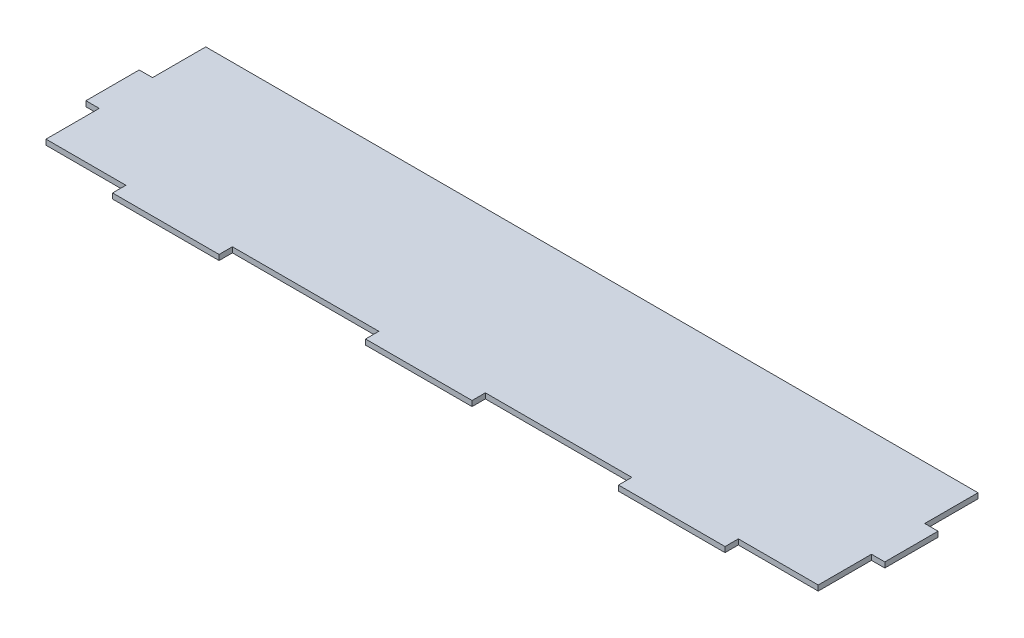
ISO-10303-21;
HEADER;
FILE_DESCRIPTION(('STEP AP214'),'2;1');
FILE_NAME('part.step','',(''),(''),'','','');
FILE_SCHEMA(('AUTOMOTIVE_DESIGN { 1 0 10303 214 1 1 1 1 }'));
ENDSEC;
DATA;
#1=APPLICATION_CONTEXT('core data for automotive mechanical design processes');
#2=APPLICATION_PROTOCOL_DEFINITION('international standard','automotive_design',2000,#1);
#3=PRODUCT_CONTEXT('',#1,'mechanical');
#4=PRODUCT('Part','Part','',(#3));
#5=PRODUCT_RELATED_PRODUCT_CATEGORY('part','',(#4));
#6=PRODUCT_DEFINITION_FORMATION('','',#4);
#7=PRODUCT_DEFINITION_CONTEXT('part definition',#1,'design');
#8=PRODUCT_DEFINITION('design','',#6,#7);
#9=PRODUCT_DEFINITION_SHAPE('','',#8);
#10=(LENGTH_UNIT() NAMED_UNIT(*) SI_UNIT(.MILLI.,.METRE.));
#11=(NAMED_UNIT(*) PLANE_ANGLE_UNIT() SI_UNIT($,.RADIAN.));
#12=(NAMED_UNIT(*) SI_UNIT($,.STERADIAN.) SOLID_ANGLE_UNIT());
#13=UNCERTAINTY_MEASURE_WITH_UNIT(LENGTH_MEASURE(1.E-05),#10,'distance_accuracy_value','');
#14=(GEOMETRIC_REPRESENTATION_CONTEXT(3) GLOBAL_UNCERTAINTY_ASSIGNED_CONTEXT((#13)) GLOBAL_UNIT_ASSIGNED_CONTEXT((#10,
#11,#12)) REPRESENTATION_CONTEXT('',''));
#15=CARTESIAN_POINT('',(0.,0.,0.));
#16=DIRECTION('',(0.,0.,1.));
#17=DIRECTION('',(1.,0.,0.));
#18=AXIS2_PLACEMENT_3D('',#15,#16,#17);
#19=CARTESIAN_POINT('',(215.9,2.54,0.));
#20=DIRECTION('',(1.,0.,0.));
#21=DIRECTION('',(0.,0.,-1.));
#22=AXIS2_PLACEMENT_3D('',#19,#20,#21);
#23=PLANE('',#22);
#24=DIRECTION('',(0.,0.,1.));
#25=VECTOR('',#24,1.);
#26=CARTESIAN_POINT('',(215.9,0.,0.));
#27=LINE('',#26,#25);
#28=CARTESIAN_POINT('',(215.9,0.,38.3659866827179));
#29=VERTEX_POINT('',#28);
#30=CARTESIAN_POINT('',(215.9,0.,44.7159866827179));
#31=VERTEX_POINT('',#30);
#32=EDGE_CURVE('E221',#29,#31,#27,.T.);
#33=ORIENTED_EDGE('',*,*,#32,.F.);
#34=DIRECTION('',(0.,-1.,0.));
#35=VECTOR('',#34,1.);
#36=CARTESIAN_POINT('',(215.9,2.54,38.3659866827179));
#37=LINE('',#36,#35);
#38=CARTESIAN_POINT('',(215.9,2.54,38.3659866827179));
#39=VERTEX_POINT('',#38);
#40=EDGE_CURVE('E11',#39,#29,#37,.T.);
#41=ORIENTED_EDGE('',*,*,#40,.F.);
#42=DIRECTION('',(0.,0.,1.));
#43=VECTOR('',#42,1.);
#44=CARTESIAN_POINT('',(215.9,2.54,0.));
#45=LINE('',#44,#43);
#46=CARTESIAN_POINT('',(215.9,2.54,44.7159866827179));
#47=VERTEX_POINT('',#46);
#48=EDGE_CURVE('E283',#39,#47,#45,.T.);
#49=ORIENTED_EDGE('',*,*,#48,.T.);
#50=DIRECTION('',(0.,-1.,0.));
#51=VECTOR('',#50,1.);
#52=CARTESIAN_POINT('',(215.9,2.54,44.7159866827179));
#53=LINE('',#52,#51);
#54=EDGE_CURVE('E132',#47,#31,#53,.T.);
#55=ORIENTED_EDGE('',*,*,#54,.T.);
#56=EDGE_LOOP('',(#33,#41,#49,#55));
#57=FACE_BOUND('',#56,.T.);
#58=ADVANCED_FACE('F33',(#57),#23,.T.);
#59=CARTESIAN_POINT('',(0.,2.54,38.3659866827179));
#60=DIRECTION('',(0.,0.,-1.));
#61=DIRECTION('',(-1.,0.,0.));
#62=AXIS2_PLACEMENT_3D('',#59,#60,#61);
#63=PLANE('',#62);
#64=DIRECTION('',(1.,0.,0.));
#65=VECTOR('',#64,1.);
#66=CARTESIAN_POINT('',(0.,0.,38.3659866827179));
#67=LINE('',#66,#65);
#68=CARTESIAN_POINT('',(285.75,0.,38.3659866827179));
#69=VERTEX_POINT('',#68);
#70=EDGE_CURVE('E224',#29,#69,#67,.T.);
#71=ORIENTED_EDGE('',*,*,#70,.T.);
#72=DIRECTION('',(0.,-1.,0.));
#73=VECTOR('',#72,1.);
#74=CARTESIAN_POINT('',(285.75,2.54,38.3659866827179));
#75=LINE('',#74,#73);
#76=CARTESIAN_POINT('',(285.75,2.54,38.3659866827179));
#77=VERTEX_POINT('',#76);
#78=EDGE_CURVE('E41',#77,#69,#75,.T.);
#79=ORIENTED_EDGE('',*,*,#78,.F.);
#80=DIRECTION('',(1.,0.,0.));
#81=VECTOR('',#80,1.);
#82=CARTESIAN_POINT('',(0.,2.54,38.3659866827179));
#83=LINE('',#82,#81);
#84=EDGE_CURVE('E352',#39,#77,#83,.T.);
#85=ORIENTED_EDGE('',*,*,#84,.F.);
#86=ORIENTED_EDGE('',*,*,#40,.T.);
#87=EDGE_LOOP('',(#71,#79,#85,#86));
#88=FACE_BOUND('',#87,.T.);
#89=ADVANCED_FACE('F399',(#88),#63,.F.);
#90=CARTESIAN_POINT('',(285.75,2.54,0.));
#91=DIRECTION('',(1.,0.,0.));
#92=DIRECTION('',(0.,0.,-1.));
#93=AXIS2_PLACEMENT_3D('',#90,#91,#92);
#94=PLANE('',#93);
#95=DIRECTION('',(0.,0.,1.));
#96=VECTOR('',#95,1.);
#97=CARTESIAN_POINT('',(285.75,0.,0.));
#98=LINE('',#97,#96);
#99=CARTESIAN_POINT('',(285.75,0.,44.7159866827179));
#100=VERTEX_POINT('',#99);
#101=EDGE_CURVE('E226',#69,#100,#98,.T.);
#102=ORIENTED_EDGE('',*,*,#101,.T.);
#103=DIRECTION('',(0.,-1.,0.));
#104=VECTOR('',#103,1.);
#105=CARTESIAN_POINT('',(285.75,2.54,44.7159866827179));
#106=LINE('',#105,#104);
#107=CARTESIAN_POINT('',(285.75,2.54,44.7159866827179));
#108=VERTEX_POINT('',#107);
#109=EDGE_CURVE('E325',#108,#100,#106,.T.);
#110=ORIENTED_EDGE('',*,*,#109,.F.);
#111=DIRECTION('',(0.,0.,1.));
#112=VECTOR('',#111,1.);
#113=CARTESIAN_POINT('',(285.75,2.54,0.));
#114=LINE('',#113,#112);
#115=EDGE_CURVE('E333',#77,#108,#114,.T.);
#116=ORIENTED_EDGE('',*,*,#115,.F.);
#117=ORIENTED_EDGE('',*,*,#78,.T.);
#118=EDGE_LOOP('',(#102,#110,#116,#117));
#119=FACE_BOUND('',#118,.T.);
#120=ADVANCED_FACE('F331',(#119),#94,.F.);
#121=CARTESIAN_POINT('',(0.,2.54,44.715986682718));
#122=DIRECTION('',(0.,0.,1.));
#123=DIRECTION('',(1.,0.,0.));
#124=AXIS2_PLACEMENT_3D('',#121,#122,#123);
#125=PLANE('',#124);
#126=DIRECTION('',(-1.,0.,0.));
#127=VECTOR('',#126,1.);
#128=CARTESIAN_POINT('',(0.,0.,44.715986682718));
#129=LINE('',#128,#127);
#130=CARTESIAN_POINT('',(336.55,0.,44.7159866827179));
#131=VERTEX_POINT('',#130);
#132=EDGE_CURVE('E229',#131,#100,#129,.T.);
#133=ORIENTED_EDGE('',*,*,#132,.F.);
#134=DIRECTION('',(0.,-1.,0.));
#135=VECTOR('',#134,1.);
#136=CARTESIAN_POINT('',(336.55,2.54,44.7159866827179));
#137=LINE('',#136,#135);
#138=CARTESIAN_POINT('',(336.55,2.54,44.7159866827179));
#139=VERTEX_POINT('',#138);
#140=EDGE_CURVE('E323',#139,#131,#137,.T.);
#141=ORIENTED_EDGE('',*,*,#140,.F.);
#142=DIRECTION('',(-1.,0.,0.));
#143=VECTOR('',#142,1.);
#144=CARTESIAN_POINT('',(0.,2.54,44.715986682718));
#145=LINE('',#144,#143);
#146=EDGE_CURVE('E345',#139,#108,#145,.T.);
#147=ORIENTED_EDGE('',*,*,#146,.T.);
#148=ORIENTED_EDGE('',*,*,#109,.T.);
#149=EDGE_LOOP('',(#133,#141,#147,#148));
#150=FACE_BOUND('',#149,.T.);
#151=ADVANCED_FACE('F342',(#150),#125,.T.);
#152=CARTESIAN_POINT('',(336.55,2.54,0.));
#153=DIRECTION('',(1.,0.,0.));
#154=DIRECTION('',(0.,0.,-1.));
#155=AXIS2_PLACEMENT_3D('',#152,#153,#154);
#156=PLANE('',#155);
#157=DIRECTION('',(0.,0.,1.));
#158=VECTOR('',#157,1.);
#159=CARTESIAN_POINT('',(336.55,0.,0.));
#160=LINE('',#159,#158);
#161=CARTESIAN_POINT('',(336.55,0.,38.3659866827179));
#162=VERTEX_POINT('',#161);
#163=EDGE_CURVE('E232',#162,#131,#160,.T.);
#164=ORIENTED_EDGE('',*,*,#163,.F.);
#165=DIRECTION('',(0.,-1.,0.));
#166=VECTOR('',#165,1.);
#167=CARTESIAN_POINT('',(336.55,2.54,38.3659866827179));
#168=LINE('',#167,#166);
#169=CARTESIAN_POINT('',(336.55,2.54,38.3659866827179));
#170=VERTEX_POINT('',#169);
#171=EDGE_CURVE('E321',#170,#162,#168,.T.);
#172=ORIENTED_EDGE('',*,*,#171,.F.);
#173=DIRECTION('',(0.,0.,1.));
#174=VECTOR('',#173,1.);
#175=CARTESIAN_POINT('',(336.55,2.54,0.));
#176=LINE('',#175,#174);
#177=EDGE_CURVE('E348',#170,#139,#176,.T.);
#178=ORIENTED_EDGE('',*,*,#177,.T.);
#179=ORIENTED_EDGE('',*,*,#140,.T.);
#180=EDGE_LOOP('',(#164,#172,#178,#179));
#181=FACE_BOUND('',#180,.T.);
#182=ADVANCED_FACE('F409',(#181),#156,.T.);
#183=CARTESIAN_POINT('',(0.,2.54,38.3659866827179));
#184=DIRECTION('',(0.,0.,-1.));
#185=DIRECTION('',(-1.,0.,0.));
#186=AXIS2_PLACEMENT_3D('',#183,#184,#185);
#187=PLANE('',#186);
#188=DIRECTION('',(1.,0.,0.));
#189=VECTOR('',#188,1.);
#190=CARTESIAN_POINT('',(0.,0.,38.3659866827179));
#191=LINE('',#190,#189);
#192=CARTESIAN_POINT('',(374.65,0.,38.3659866827179));
#193=VERTEX_POINT('',#192);
#194=EDGE_CURVE('E235',#162,#193,#191,.T.);
#195=ORIENTED_EDGE('',*,*,#194,.T.);
#196=DIRECTION('',(0.,-1.,0.));
#197=VECTOR('',#196,1.);
#198=CARTESIAN_POINT('',(374.65,2.54,38.3659866827179));
#199=LINE('',#198,#197);
#200=CARTESIAN_POINT('',(374.65,2.54,38.3659866827179));
#201=VERTEX_POINT('',#200);
#202=EDGE_CURVE('E318',#201,#193,#199,.T.);
#203=ORIENTED_EDGE('',*,*,#202,.F.);
#204=DIRECTION('',(1.,0.,0.));
#205=VECTOR('',#204,1.);
#206=CARTESIAN_POINT('',(0.,2.54,38.3659866827179));
#207=LINE('',#206,#205);
#208=EDGE_CURVE('E350',#170,#201,#207,.T.);
#209=ORIENTED_EDGE('',*,*,#208,.F.);
#210=ORIENTED_EDGE('',*,*,#171,.T.);
#211=EDGE_LOOP('',(#195,#203,#209,#210));
#212=FACE_BOUND('',#211,.T.);
#213=ADVANCED_FACE('F412',(#212),#187,.F.);
#214=CARTESIAN_POINT('',(374.65,2.54,0.));
#215=DIRECTION('',(-1.,0.,0.));
#216=DIRECTION('',(0.,0.,1.));
#217=AXIS2_PLACEMENT_3D('',#214,#215,#216);
#218=PLANE('',#217);
#219=DIRECTION('',(0.,0.,-1.));
#220=VECTOR('',#219,1.);
#221=CARTESIAN_POINT('',(374.65,0.,0.));
#222=LINE('',#221,#220);
#223=CARTESIAN_POINT('',(374.65,0.,12.9659866827179));
#224=VERTEX_POINT('',#223);
#225=EDGE_CURVE('E237',#193,#224,#222,.T.);
#226=ORIENTED_EDGE('',*,*,#225,.T.);
#227=DIRECTION('',(0.,-1.,0.));
#228=VECTOR('',#227,1.);
#229=CARTESIAN_POINT('',(374.65,2.54,12.9659866827179));
#230=LINE('',#229,#228);
#231=CARTESIAN_POINT('',(374.65,2.54,12.9659866827179));
#232=VERTEX_POINT('',#231);
#233=EDGE_CURVE('E316',#232,#224,#230,.T.);
#234=ORIENTED_EDGE('',*,*,#233,.F.);
#235=DIRECTION('',(0.,0.,-1.));
#236=VECTOR('',#235,1.);
#237=CARTESIAN_POINT('',(374.65,2.54,0.));
#238=LINE('',#237,#236);
#239=EDGE_CURVE('E357',#201,#232,#238,.T.);
#240=ORIENTED_EDGE('',*,*,#239,.F.);
#241=ORIENTED_EDGE('',*,*,#202,.T.);
#242=EDGE_LOOP('',(#226,#234,#240,#241));
#243=FACE_BOUND('',#242,.T.);
#244=ADVANCED_FACE('F416',(#243),#218,.F.);
#245=CARTESIAN_POINT('',(0.,2.54,12.9659866827179));
#246=DIRECTION('',(0.,0.,1.));
#247=DIRECTION('',(1.,0.,0.));
#248=AXIS2_PLACEMENT_3D('',#245,#246,#247);
#249=PLANE('',#248);
#250=DIRECTION('',(-1.,0.,0.));
#251=VECTOR('',#250,1.);
#252=CARTESIAN_POINT('',(0.,0.,12.9659866827179));
#253=LINE('',#252,#251);
#254=CARTESIAN_POINT('',(381.,0.,12.9659866827179));
#255=VERTEX_POINT('',#254);
#256=EDGE_CURVE('E240',#255,#224,#253,.T.);
#257=ORIENTED_EDGE('',*,*,#256,.F.);
#258=DIRECTION('',(0.,-1.,0.));
#259=VECTOR('',#258,1.);
#260=CARTESIAN_POINT('',(381.,2.54,12.9659866827179));
#261=LINE('',#260,#259);
#262=CARTESIAN_POINT('',(381.,2.54,12.9659866827179));
#263=VERTEX_POINT('',#262);
#264=EDGE_CURVE('E314',#263,#255,#261,.T.);
#265=ORIENTED_EDGE('',*,*,#264,.F.);
#266=DIRECTION('',(-1.,0.,0.));
#267=VECTOR('',#266,1.);
#268=CARTESIAN_POINT('',(0.,2.54,12.9659866827179));
#269=LINE('',#268,#267);
#270=EDGE_CURVE('E359',#263,#232,#269,.T.);
#271=ORIENTED_EDGE('',*,*,#270,.T.);
#272=ORIENTED_EDGE('',*,*,#233,.T.);
#273=EDGE_LOOP('',(#257,#265,#271,#272));
#274=FACE_BOUND('',#273,.T.);
#275=ADVANCED_FACE('F420',(#274),#249,.T.);
#276=CARTESIAN_POINT('',(381.,2.54,0.));
#277=DIRECTION('',(1.,0.,0.));
#278=DIRECTION('',(0.,0.,-1.));
#279=AXIS2_PLACEMENT_3D('',#276,#277,#278);
#280=PLANE('',#279);
#281=DIRECTION('',(0.,0.,1.));
#282=VECTOR('',#281,1.);
#283=CARTESIAN_POINT('',(381.,0.,0.));
#284=LINE('',#283,#282);
#285=CARTESIAN_POINT('',(381.,0.,-12.4340133172821));
#286=VERTEX_POINT('',#285);
#287=EDGE_CURVE('E243',#286,#255,#284,.T.);
#288=ORIENTED_EDGE('',*,*,#287,.F.);
#289=DIRECTION('',(0.,-1.,0.));
#290=VECTOR('',#289,1.);
#291=CARTESIAN_POINT('',(381.,2.54,-12.4340133172821));
#292=LINE('',#291,#290);
#293=CARTESIAN_POINT('',(381.,2.54,-12.4340133172821));
#294=VERTEX_POINT('',#293);
#295=EDGE_CURVE('E312',#294,#286,#292,.T.);
#296=ORIENTED_EDGE('',*,*,#295,.F.);
#297=DIRECTION('',(0.,0.,1.));
#298=VECTOR('',#297,1.);
#299=CARTESIAN_POINT('',(381.,2.54,0.));
#300=LINE('',#299,#298);
#301=EDGE_CURVE('E362',#294,#263,#300,.T.);
#302=ORIENTED_EDGE('',*,*,#301,.T.);
#303=ORIENTED_EDGE('',*,*,#264,.T.);
#304=EDGE_LOOP('',(#288,#296,#302,#303));
#305=FACE_BOUND('',#304,.T.);
#306=ADVANCED_FACE('F424',(#305),#280,.T.);
#307=CARTESIAN_POINT('',(0.,2.54,-12.4340133172821));
#308=DIRECTION('',(0.,0.,1.));
#309=DIRECTION('',(1.,0.,0.));
#310=AXIS2_PLACEMENT_3D('',#307,#308,#309);
#311=PLANE('',#310);
#312=DIRECTION('',(-1.,0.,0.));
#313=VECTOR('',#312,1.);
#314=CARTESIAN_POINT('',(0.,0.,-12.4340133172821));
#315=LINE('',#314,#313);
#316=CARTESIAN_POINT('',(374.65,0.,-12.4340133172821));
#317=VERTEX_POINT('',#316);
#318=EDGE_CURVE('E246',#286,#317,#315,.T.);
#319=ORIENTED_EDGE('',*,*,#318,.T.);
#320=DIRECTION('',(0.,-1.,0.));
#321=VECTOR('',#320,1.);
#322=CARTESIAN_POINT('',(374.65,2.54,-12.4340133172821));
#323=LINE('',#322,#321);
#324=CARTESIAN_POINT('',(374.65,2.54,-12.4340133172821));
#325=VERTEX_POINT('',#324);
#326=EDGE_CURVE('E310',#325,#317,#323,.T.);
#327=ORIENTED_EDGE('',*,*,#326,.F.);
#328=DIRECTION('',(-1.,0.,0.));
#329=VECTOR('',#328,1.);
#330=CARTESIAN_POINT('',(0.,2.54,-12.4340133172821));
#331=LINE('',#330,#329);
#332=EDGE_CURVE('E365',#294,#325,#331,.T.);
#333=ORIENTED_EDGE('',*,*,#332,.F.);
#334=ORIENTED_EDGE('',*,*,#295,.T.);
#335=EDGE_LOOP('',(#319,#327,#333,#334));
#336=FACE_BOUND('',#335,.T.);
#337=ADVANCED_FACE('F428',(#336),#311,.F.);
#338=CARTESIAN_POINT('',(374.65,2.54,0.));
#339=DIRECTION('',(1.,0.,0.));
#340=DIRECTION('',(0.,0.,-1.));
#341=AXIS2_PLACEMENT_3D('',#338,#339,#340);
#342=PLANE('',#341);
#343=DIRECTION('',(0.,0.,1.));
#344=VECTOR('',#343,1.);
#345=CARTESIAN_POINT('',(374.65,0.,0.));
#346=LINE('',#345,#344);
#347=CARTESIAN_POINT('',(374.65,0.,-37.8340133172821));
#348=VERTEX_POINT('',#347);
#349=EDGE_CURVE('E249',#348,#317,#346,.T.);
#350=ORIENTED_EDGE('',*,*,#349,.F.);
#351=DIRECTION('',(0.,-1.,0.));
#352=VECTOR('',#351,1.);
#353=CARTESIAN_POINT('',(374.65,2.54,-37.8340133172821));
#354=LINE('',#353,#352);
#355=CARTESIAN_POINT('',(374.65,2.54,-37.8340133172821));
#356=VERTEX_POINT('',#355);
#357=EDGE_CURVE('E308',#356,#348,#354,.T.);
#358=ORIENTED_EDGE('',*,*,#357,.F.);
#359=DIRECTION('',(0.,0.,1.));
#360=VECTOR('',#359,1.);
#361=CARTESIAN_POINT('',(374.65,2.54,0.));
#362=LINE('',#361,#360);
#363=EDGE_CURVE('E367',#356,#325,#362,.T.);
#364=ORIENTED_EDGE('',*,*,#363,.T.);
#365=ORIENTED_EDGE('',*,*,#326,.T.);
#366=EDGE_LOOP('',(#350,#358,#364,#365));
#367=FACE_BOUND('',#366,.T.);
#368=ADVANCED_FACE('F432',(#367),#342,.T.);
#369=CARTESIAN_POINT('',(0.,2.54,-37.8340133172821));
#370=DIRECTION('',(0.,0.,-1.));
#371=DIRECTION('',(-1.,0.,0.));
#372=AXIS2_PLACEMENT_3D('',#369,#370,#371);
#373=PLANE('',#372);
#374=DIRECTION('',(1.,0.,0.));
#375=VECTOR('',#374,1.);
#376=CARTESIAN_POINT('',(0.,0.,-37.8340133172821));
#377=LINE('',#376,#375);
#378=CARTESIAN_POINT('',(6.35,0.,-37.8340133172821));
#379=VERTEX_POINT('',#378);
#380=EDGE_CURVE('E252',#379,#348,#377,.T.);
#381=ORIENTED_EDGE('',*,*,#380,.F.);
#382=DIRECTION('',(0.,-1.,0.));
#383=VECTOR('',#382,1.);
#384=CARTESIAN_POINT('',(6.35,2.54,-37.8340133172821));
#385=LINE('',#384,#383);
#386=CARTESIAN_POINT('',(6.35,2.54,-37.8340133172821));
#387=VERTEX_POINT('',#386);
#388=EDGE_CURVE('E306',#387,#379,#385,.T.);
#389=ORIENTED_EDGE('',*,*,#388,.F.);
#390=DIRECTION('',(1.,0.,0.));
#391=VECTOR('',#390,1.);
#392=CARTESIAN_POINT('',(0.,2.54,-37.8340133172821));
#393=LINE('',#392,#391);
#394=EDGE_CURVE('E370',#387,#356,#393,.T.);
#395=ORIENTED_EDGE('',*,*,#394,.T.);
#396=ORIENTED_EDGE('',*,*,#357,.T.);
#397=EDGE_LOOP('',(#381,#389,#395,#396));
#398=FACE_BOUND('',#397,.T.);
#399=ADVANCED_FACE('F436',(#398),#373,.T.);
#400=CARTESIAN_POINT('',(6.35000000000001,2.54,0.));
#401=DIRECTION('',(1.,0.,0.));
#402=DIRECTION('',(0.,0.,-1.));
#403=AXIS2_PLACEMENT_3D('',#400,#401,#402);
#404=PLANE('',#403);
#405=DIRECTION('',(0.,0.,1.));
#406=VECTOR('',#405,1.);
#407=CARTESIAN_POINT('',(6.35000000000001,0.,0.));
#408=LINE('',#407,#406);
#409=CARTESIAN_POINT('',(6.35000000000001,0.,-12.4340133172821));
#410=VERTEX_POINT('',#409);
#411=EDGE_CURVE('E255',#379,#410,#408,.T.);
#412=ORIENTED_EDGE('',*,*,#411,.T.);
#413=DIRECTION('',(0.,-1.,0.));
#414=VECTOR('',#413,1.);
#415=CARTESIAN_POINT('',(6.35000000000001,2.54,-12.4340133172821));
#416=LINE('',#415,#414);
#417=CARTESIAN_POINT('',(6.35000000000001,2.54,-12.4340133172821));
#418=VERTEX_POINT('',#417);
#419=EDGE_CURVE('E304',#418,#410,#416,.T.);
#420=ORIENTED_EDGE('',*,*,#419,.F.);
#421=DIRECTION('',(0.,0.,1.));
#422=VECTOR('',#421,1.);
#423=CARTESIAN_POINT('',(6.35000000000001,2.54,0.));
#424=LINE('',#423,#422);
#425=EDGE_CURVE('E373',#387,#418,#424,.T.);
#426=ORIENTED_EDGE('',*,*,#425,.F.);
#427=ORIENTED_EDGE('',*,*,#388,.T.);
#428=EDGE_LOOP('',(#412,#420,#426,#427));
#429=FACE_BOUND('',#428,.T.);
#430=ADVANCED_FACE('F440',(#429),#404,.F.);
#431=CARTESIAN_POINT('',(0.,2.54,-12.4340133172821));
#432=DIRECTION('',(0.,0.,-1.));
#433=DIRECTION('',(-1.,0.,0.));
#434=AXIS2_PLACEMENT_3D('',#431,#432,#433);
#435=PLANE('',#434);
#436=DIRECTION('',(1.,0.,0.));
#437=VECTOR('',#436,1.);
#438=CARTESIAN_POINT('',(0.,0.,-12.4340133172821));
#439=LINE('',#438,#437);
#440=CARTESIAN_POINT('',(0.,0.,-12.4340133172821));
#441=VERTEX_POINT('',#440);
#442=EDGE_CURVE('E258',#441,#410,#439,.T.);
#443=ORIENTED_EDGE('',*,*,#442,.F.);
#444=DIRECTION('',(0.,-1.,0.));
#445=VECTOR('',#444,1.);
#446=CARTESIAN_POINT('',(0.,2.54,-12.4340133172821));
#447=LINE('',#446,#445);
#448=CARTESIAN_POINT('',(0.,2.54,-12.4340133172821));
#449=VERTEX_POINT('',#448);
#450=EDGE_CURVE('E302',#449,#441,#447,.T.);
#451=ORIENTED_EDGE('',*,*,#450,.F.);
#452=DIRECTION('',(1.,0.,0.));
#453=VECTOR('',#452,1.);
#454=CARTESIAN_POINT('',(0.,2.54,-12.4340133172821));
#455=LINE('',#454,#453);
#456=EDGE_CURVE('E375',#449,#418,#455,.T.);
#457=ORIENTED_EDGE('',*,*,#456,.T.);
#458=ORIENTED_EDGE('',*,*,#419,.T.);
#459=EDGE_LOOP('',(#443,#451,#457,#458));
#460=FACE_BOUND('',#459,.T.);
#461=ADVANCED_FACE('F444',(#460),#435,.T.);
#462=CARTESIAN_POINT('',(0.,2.54,0.));
#463=DIRECTION('',(1.,0.,0.));
#464=DIRECTION('',(0.,0.,-1.));
#465=AXIS2_PLACEMENT_3D('',#462,#463,#464);
#466=PLANE('',#465);
#467=DIRECTION('',(0.,0.,1.));
#468=VECTOR('',#467,1.);
#469=CARTESIAN_POINT('',(0.,0.,0.));
#470=LINE('',#469,#468);
#471=CARTESIAN_POINT('',(0.,0.,12.9659866827179));
#472=VERTEX_POINT('',#471);
#473=EDGE_CURVE('E261',#441,#472,#470,.T.);
#474=ORIENTED_EDGE('',*,*,#473,.T.);
#475=DIRECTION('',(0.,-1.,0.));
#476=VECTOR('',#475,1.);
#477=CARTESIAN_POINT('',(0.,2.54,12.9659866827179));
#478=LINE('',#477,#476);
#479=CARTESIAN_POINT('',(0.,2.54,12.9659866827179));
#480=VERTEX_POINT('',#479);
#481=EDGE_CURVE('E299',#480,#472,#478,.T.);
#482=ORIENTED_EDGE('',*,*,#481,.F.);
#483=DIRECTION('',(0.,0.,1.));
#484=VECTOR('',#483,1.);
#485=CARTESIAN_POINT('',(0.,2.54,0.));
#486=LINE('',#485,#484);
#487=EDGE_CURVE('E378',#449,#480,#486,.T.);
#488=ORIENTED_EDGE('',*,*,#487,.F.);
#489=ORIENTED_EDGE('',*,*,#450,.T.);
#490=EDGE_LOOP('',(#474,#482,#488,#489));
#491=FACE_BOUND('',#490,.T.);
#492=ADVANCED_FACE('F448',(#491),#466,.F.);
#493=CARTESIAN_POINT('',(0.,2.54,12.9659866827179));
#494=DIRECTION('',(0.,0.,-1.));
#495=DIRECTION('',(-1.,0.,0.));
#496=AXIS2_PLACEMENT_3D('',#493,#494,#495);
#497=PLANE('',#496);
#498=DIRECTION('',(1.,0.,0.));
#499=VECTOR('',#498,1.);
#500=CARTESIAN_POINT('',(0.,0.,12.9659866827179));
#501=LINE('',#500,#499);
#502=CARTESIAN_POINT('',(6.35000000000001,0.,12.9659866827179));
#503=VERTEX_POINT('',#502);
#504=EDGE_CURVE('E263',#472,#503,#501,.T.);
#505=ORIENTED_EDGE('',*,*,#504,.T.);
#506=DIRECTION('',(0.,-1.,0.));
#507=VECTOR('',#506,1.);
#508=CARTESIAN_POINT('',(6.35000000000001,2.54,12.9659866827179));
#509=LINE('',#508,#507);
#510=CARTESIAN_POINT('',(6.35000000000001,2.54,12.9659866827179));
#511=VERTEX_POINT('',#510);
#512=EDGE_CURVE('E297',#511,#503,#509,.T.);
#513=ORIENTED_EDGE('',*,*,#512,.F.);
#514=DIRECTION('',(1.,0.,0.));
#515=VECTOR('',#514,1.);
#516=CARTESIAN_POINT('',(0.,2.54,12.9659866827179));
#517=LINE('',#516,#515);
#518=EDGE_CURVE('E380',#480,#511,#517,.T.);
#519=ORIENTED_EDGE('',*,*,#518,.F.);
#520=ORIENTED_EDGE('',*,*,#481,.T.);
#521=EDGE_LOOP('',(#505,#513,#519,#520));
#522=FACE_BOUND('',#521,.T.);
#523=ADVANCED_FACE('F452',(#522),#497,.F.);
#524=CARTESIAN_POINT('',(6.35000000000001,2.54,0.));
#525=DIRECTION('',(-1.,0.,0.));
#526=DIRECTION('',(0.,0.,1.));
#527=AXIS2_PLACEMENT_3D('',#524,#525,#526);
#528=PLANE('',#527);
#529=DIRECTION('',(0.,0.,-1.));
#530=VECTOR('',#529,1.);
#531=CARTESIAN_POINT('',(6.35000000000001,0.,0.));
#532=LINE('',#531,#530);
#533=CARTESIAN_POINT('',(6.35000000000001,0.,38.3659866827179));
#534=VERTEX_POINT('',#533);
#535=EDGE_CURVE('E266',#534,#503,#532,.T.);
#536=ORIENTED_EDGE('',*,*,#535,.F.);
#537=DIRECTION('',(0.,-1.,0.));
#538=VECTOR('',#537,1.);
#539=CARTESIAN_POINT('',(6.35000000000001,2.54,38.3659866827179));
#540=LINE('',#539,#538);
#541=CARTESIAN_POINT('',(6.35000000000001,2.54,38.3659866827179));
#542=VERTEX_POINT('',#541);
#543=EDGE_CURVE('E295',#542,#534,#540,.T.);
#544=ORIENTED_EDGE('',*,*,#543,.F.);
#545=DIRECTION('',(0.,0.,-1.));
#546=VECTOR('',#545,1.);
#547=CARTESIAN_POINT('',(6.35000000000001,2.54,0.));
#548=LINE('',#547,#546);
#549=EDGE_CURVE('E382',#542,#511,#548,.T.);
#550=ORIENTED_EDGE('',*,*,#549,.T.);
#551=ORIENTED_EDGE('',*,*,#512,.T.);
#552=EDGE_LOOP('',(#536,#544,#550,#551));
#553=FACE_BOUND('',#552,.T.);
#554=ADVANCED_FACE('F456',(#553),#528,.T.);
#555=CARTESIAN_POINT('',(0.,2.54,38.3659866827179));
#556=DIRECTION('',(0.,0.,-1.));
#557=DIRECTION('',(-1.,0.,0.));
#558=AXIS2_PLACEMENT_3D('',#555,#556,#557);
#559=PLANE('',#558);
#560=DIRECTION('',(1.,0.,0.));
#561=VECTOR('',#560,1.);
#562=CARTESIAN_POINT('',(0.,0.,38.3659866827179));
#563=LINE('',#562,#561);
#564=CARTESIAN_POINT('',(44.45,0.,38.3659866827179));
#565=VERTEX_POINT('',#564);
#566=EDGE_CURVE('E269',#534,#565,#563,.T.);
#567=ORIENTED_EDGE('',*,*,#566,.T.);
#568=DIRECTION('',(0.,-1.,0.));
#569=VECTOR('',#568,1.);
#570=CARTESIAN_POINT('',(44.45,2.54,38.3659866827179));
#571=LINE('',#570,#569);
#572=CARTESIAN_POINT('',(44.45,2.54,38.3659866827179));
#573=VERTEX_POINT('',#572);
#574=EDGE_CURVE('E292',#573,#565,#571,.T.);
#575=ORIENTED_EDGE('',*,*,#574,.F.);
#576=DIRECTION('',(1.,0.,0.));
#577=VECTOR('',#576,1.);
#578=CARTESIAN_POINT('',(0.,2.54,38.3659866827179));
#579=LINE('',#578,#577);
#580=EDGE_CURVE('E385',#542,#573,#579,.T.);
#581=ORIENTED_EDGE('',*,*,#580,.F.);
#582=ORIENTED_EDGE('',*,*,#543,.T.);
#583=EDGE_LOOP('',(#567,#575,#581,#582));
#584=FACE_BOUND('',#583,.T.);
#585=ADVANCED_FACE('F460',(#584),#559,.F.);
#586=CARTESIAN_POINT('',(44.45,2.54,0.));
#587=DIRECTION('',(1.,0.,0.));
#588=DIRECTION('',(0.,0.,-1.));
#589=AXIS2_PLACEMENT_3D('',#586,#587,#588);
#590=PLANE('',#589);
#591=DIRECTION('',(0.,0.,1.));
#592=VECTOR('',#591,1.);
#593=CARTESIAN_POINT('',(44.45,0.,0.));
#594=LINE('',#593,#592);
#595=CARTESIAN_POINT('',(44.45,0.,44.7159866827179));
#596=VERTEX_POINT('',#595);
#597=EDGE_CURVE('E271',#565,#596,#594,.T.);
#598=ORIENTED_EDGE('',*,*,#597,.T.);
#599=DIRECTION('',(0.,-1.,0.));
#600=VECTOR('',#599,1.);
#601=CARTESIAN_POINT('',(44.45,2.54,44.7159866827179));
#602=LINE('',#601,#600);
#603=CARTESIAN_POINT('',(44.45,2.54,44.7159866827179));
#604=VERTEX_POINT('',#603);
#605=EDGE_CURVE('E289',#604,#596,#602,.T.);
#606=ORIENTED_EDGE('',*,*,#605,.F.);
#607=DIRECTION('',(0.,0.,1.));
#608=VECTOR('',#607,1.);
#609=CARTESIAN_POINT('',(44.45,2.54,0.));
#610=LINE('',#609,#608);
#611=EDGE_CURVE('E387',#573,#604,#610,.T.);
#612=ORIENTED_EDGE('',*,*,#611,.F.);
#613=ORIENTED_EDGE('',*,*,#574,.T.);
#614=EDGE_LOOP('',(#598,#606,#612,#613));
#615=FACE_BOUND('',#614,.T.);
#616=ADVANCED_FACE('F464',(#615),#590,.F.);
#617=CARTESIAN_POINT('',(0.,2.54,44.7159866827179));
#618=DIRECTION('',(0.,0.,-1.));
#619=DIRECTION('',(-1.,0.,0.));
#620=AXIS2_PLACEMENT_3D('',#617,#618,#619);
#621=PLANE('',#620);
#622=DIRECTION('',(1.,0.,0.));
#623=VECTOR('',#622,1.);
#624=CARTESIAN_POINT('',(0.,0.,44.7159866827179));
#625=LINE('',#624,#623);
#626=CARTESIAN_POINT('',(95.25,0.,44.7159866827179));
#627=VERTEX_POINT('',#626);
#628=EDGE_CURVE('E273',#596,#627,#625,.T.);
#629=ORIENTED_EDGE('',*,*,#628,.T.);
#630=DIRECTION('',(0.,-1.,0.));
#631=VECTOR('',#630,1.);
#632=CARTESIAN_POINT('',(95.25,2.54,44.7159866827179));
#633=LINE('',#632,#631);
#634=CARTESIAN_POINT('',(95.25,2.54,44.7159866827179));
#635=VERTEX_POINT('',#634);
#636=EDGE_CURVE('E287',#635,#627,#633,.T.);
#637=ORIENTED_EDGE('',*,*,#636,.F.);
#638=DIRECTION('',(1.,0.,0.));
#639=VECTOR('',#638,1.);
#640=CARTESIAN_POINT('',(0.,2.54,44.7159866827179));
#641=LINE('',#640,#639);
#642=EDGE_CURVE('E389',#604,#635,#641,.T.);
#643=ORIENTED_EDGE('',*,*,#642,.F.);
#644=ORIENTED_EDGE('',*,*,#605,.T.);
#645=EDGE_LOOP('',(#629,#637,#643,#644));
#646=FACE_BOUND('',#645,.T.);
#647=ADVANCED_FACE('F468',(#646),#621,.F.);
#648=CARTESIAN_POINT('',(95.2500000000001,2.54,2.08166817117217E-13));
#649=DIRECTION('',(1.,0.,0.));
#650=DIRECTION('',(0.,0.,-1.));
#651=AXIS2_PLACEMENT_3D('',#648,#649,#650);
#652=PLANE('',#651);
#653=DIRECTION('',(0.,0.,1.));
#654=VECTOR('',#653,1.);
#655=CARTESIAN_POINT('',(95.2500000000001,0.,2.08166817117217E-13));
#656=LINE('',#655,#654);
#657=CARTESIAN_POINT('',(95.25,0.,38.3659866827179));
#658=VERTEX_POINT('',#657);
#659=EDGE_CURVE('E276',#658,#627,#656,.T.);
#660=ORIENTED_EDGE('',*,*,#659,.F.);
#661=DIRECTION('',(0.,-1.,0.));
#662=VECTOR('',#661,1.);
#663=CARTESIAN_POINT('',(95.25,2.54,38.3659866827179));
#664=LINE('',#663,#662);
#665=CARTESIAN_POINT('',(95.25,2.54,38.3659866827179));
#666=VERTEX_POINT('',#665);
#667=EDGE_CURVE('E213',#666,#658,#664,.T.);
#668=ORIENTED_EDGE('',*,*,#667,.F.);
#669=DIRECTION('',(0.,0.,1.));
#670=VECTOR('',#669,1.);
#671=CARTESIAN_POINT('',(95.2500000000001,2.54,2.08166817117217E-13));
#672=LINE('',#671,#670);
#673=EDGE_CURVE('E206',#666,#635,#672,.T.);
#674=ORIENTED_EDGE('',*,*,#673,.T.);
#675=ORIENTED_EDGE('',*,*,#636,.T.);
#676=EDGE_LOOP('',(#660,#668,#674,#675));
#677=FACE_BOUND('',#676,.T.);
#678=ADVANCED_FACE('F392',(#677),#652,.T.);
#679=CARTESIAN_POINT('',(0.,2.54,38.3659866827179));
#680=DIRECTION('',(0.,0.,-1.));
#681=DIRECTION('',(-1.,0.,0.));
#682=AXIS2_PLACEMENT_3D('',#679,#680,#681);
#683=PLANE('',#682);
#684=DIRECTION('',(1.,0.,0.));
#685=VECTOR('',#684,1.);
#686=CARTESIAN_POINT('',(0.,0.,38.3659866827179));
#687=LINE('',#686,#685);
#688=CARTESIAN_POINT('',(165.1,0.,38.3659866827179));
#689=VERTEX_POINT('',#688);
#690=EDGE_CURVE('E212',#658,#689,#687,.T.);
#691=ORIENTED_EDGE('',*,*,#690,.T.);
#692=DIRECTION('',(0.,-1.,0.));
#693=VECTOR('',#692,1.);
#694=CARTESIAN_POINT('',(165.1,2.54,38.3659866827179));
#695=LINE('',#694,#693);
#696=CARTESIAN_POINT('',(165.1,2.54,38.3659866827179));
#697=VERTEX_POINT('',#696);
#698=EDGE_CURVE('E209',#697,#689,#695,.T.);
#699=ORIENTED_EDGE('',*,*,#698,.F.);
#700=DIRECTION('',(1.,0.,0.));
#701=VECTOR('',#700,1.);
#702=CARTESIAN_POINT('',(0.,2.54,38.3659866827179));
#703=LINE('',#702,#701);
#704=EDGE_CURVE('E200',#666,#697,#703,.T.);
#705=ORIENTED_EDGE('',*,*,#704,.F.);
#706=ORIENTED_EDGE('',*,*,#667,.T.);
#707=EDGE_LOOP('',(#691,#699,#705,#706));
#708=FACE_BOUND('',#707,.T.);
#709=ADVANCED_FACE('F210',(#708),#683,.F.);
#710=CARTESIAN_POINT('',(165.1,2.54,0.));
#711=DIRECTION('',(1.,0.,0.));
#712=DIRECTION('',(0.,0.,-1.));
#713=AXIS2_PLACEMENT_3D('',#710,#711,#712);
#714=PLANE('',#713);
#715=DIRECTION('',(0.,0.,1.));
#716=VECTOR('',#715,1.);
#717=CARTESIAN_POINT('',(165.1,0.,0.));
#718=LINE('',#717,#716);
#719=CARTESIAN_POINT('',(165.1,0.,44.7159866827179));
#720=VERTEX_POINT('',#719);
#721=EDGE_CURVE('E125',#689,#720,#718,.T.);
#722=ORIENTED_EDGE('',*,*,#721,.T.);
#723=DIRECTION('',(0.,-1.,0.));
#724=VECTOR('',#723,1.);
#725=CARTESIAN_POINT('',(165.1,2.54,44.7159866827179));
#726=LINE('',#725,#724);
#727=CARTESIAN_POINT('',(165.1,2.54,44.7159866827179));
#728=VERTEX_POINT('',#727);
#729=EDGE_CURVE('E214',#728,#720,#726,.T.);
#730=ORIENTED_EDGE('',*,*,#729,.F.);
#731=DIRECTION('',(0.,0.,1.));
#732=VECTOR('',#731,1.);
#733=CARTESIAN_POINT('',(165.1,2.54,0.));
#734=LINE('',#733,#732);
#735=EDGE_CURVE('E204',#697,#728,#734,.T.);
#736=ORIENTED_EDGE('',*,*,#735,.F.);
#737=ORIENTED_EDGE('',*,*,#698,.T.);
#738=EDGE_LOOP('',(#722,#730,#736,#737));
#739=FACE_BOUND('',#738,.T.);
#740=ADVANCED_FACE('F216',(#739),#714,.F.);
#741=CARTESIAN_POINT('',(0.,2.54,44.715986682718));
#742=DIRECTION('',(0.,0.,-1.));
#743=DIRECTION('',(-1.,0.,0.));
#744=AXIS2_PLACEMENT_3D('',#741,#742,#743);
#745=PLANE('',#744);
#746=DIRECTION('',(1.,0.,0.));
#747=VECTOR('',#746,1.);
#748=CARTESIAN_POINT('',(0.,0.,44.715986682718));
#749=LINE('',#748,#747);
#750=EDGE_CURVE('E281',#720,#31,#749,.T.);
#751=ORIENTED_EDGE('',*,*,#750,.T.);
#752=ORIENTED_EDGE('',*,*,#54,.F.);
#753=DIRECTION('',(1.,0.,0.));
#754=VECTOR('',#753,1.);
#755=CARTESIAN_POINT('',(0.,2.54,44.715986682718));
#756=LINE('',#755,#754);
#757=EDGE_CURVE('E49',#728,#47,#756,.T.);
#758=ORIENTED_EDGE('',*,*,#757,.F.);
#759=ORIENTED_EDGE('',*,*,#729,.T.);
#760=EDGE_LOOP('',(#751,#752,#758,#759));
#761=FACE_BOUND('',#760,.T.);
#762=ADVANCED_FACE('F397',(#761),#745,.F.);
#763=CARTESIAN_POINT('',(0.,2.54,0.));
#764=DIRECTION('',(0.,1.,0.));
#765=DIRECTION('',(0.,0.,1.));
#766=AXIS2_PLACEMENT_3D('',#763,#764,#765);
#767=PLANE('',#766);
#768=ORIENTED_EDGE('',*,*,#48,.F.);
#769=ORIENTED_EDGE('',*,*,#84,.T.);
#770=ORIENTED_EDGE('',*,*,#115,.T.);
#771=ORIENTED_EDGE('',*,*,#146,.F.);
#772=ORIENTED_EDGE('',*,*,#177,.F.);
#773=ORIENTED_EDGE('',*,*,#208,.T.);
#774=ORIENTED_EDGE('',*,*,#239,.T.);
#775=ORIENTED_EDGE('',*,*,#270,.F.);
#776=ORIENTED_EDGE('',*,*,#301,.F.);
#777=ORIENTED_EDGE('',*,*,#332,.T.);
#778=ORIENTED_EDGE('',*,*,#363,.F.);
#779=ORIENTED_EDGE('',*,*,#394,.F.);
#780=ORIENTED_EDGE('',*,*,#425,.T.);
#781=ORIENTED_EDGE('',*,*,#456,.F.);
#782=ORIENTED_EDGE('',*,*,#487,.T.);
#783=ORIENTED_EDGE('',*,*,#518,.T.);
#784=ORIENTED_EDGE('',*,*,#549,.F.);
#785=ORIENTED_EDGE('',*,*,#580,.T.);
#786=ORIENTED_EDGE('',*,*,#611,.T.);
#787=ORIENTED_EDGE('',*,*,#642,.T.);
#788=ORIENTED_EDGE('',*,*,#673,.F.);
#789=ORIENTED_EDGE('',*,*,#704,.T.);
#790=ORIENTED_EDGE('',*,*,#735,.T.);
#791=ORIENTED_EDGE('',*,*,#757,.T.);
#792=EDGE_LOOP('',(#768,#769,#770,#771,#772,#773,#774,#775,#776,#777,#778,#779,#780,#781,#782,
#783,#784,#785,#786,#787,#788,#789,#790,#791));
#793=FACE_BOUND('',#792,.T.);
#794=ADVANCED_FACE('F202',(#793),#767,.T.);
#795=CARTESIAN_POINT('',(0.,0.,0.));
#796=DIRECTION('',(0.,1.,0.));
#797=DIRECTION('',(0.,0.,1.));
#798=AXIS2_PLACEMENT_3D('',#795,#796,#797);
#799=PLANE('',#798);
#800=ORIENTED_EDGE('',*,*,#32,.T.);
#801=ORIENTED_EDGE('',*,*,#750,.F.);
#802=ORIENTED_EDGE('',*,*,#721,.F.);
#803=ORIENTED_EDGE('',*,*,#690,.F.);
#804=ORIENTED_EDGE('',*,*,#659,.T.);
#805=ORIENTED_EDGE('',*,*,#628,.F.);
#806=ORIENTED_EDGE('',*,*,#597,.F.);
#807=ORIENTED_EDGE('',*,*,#566,.F.);
#808=ORIENTED_EDGE('',*,*,#535,.T.);
#809=ORIENTED_EDGE('',*,*,#504,.F.);
#810=ORIENTED_EDGE('',*,*,#473,.F.);
#811=ORIENTED_EDGE('',*,*,#442,.T.);
#812=ORIENTED_EDGE('',*,*,#411,.F.);
#813=ORIENTED_EDGE('',*,*,#380,.T.);
#814=ORIENTED_EDGE('',*,*,#349,.T.);
#815=ORIENTED_EDGE('',*,*,#318,.F.);
#816=ORIENTED_EDGE('',*,*,#287,.T.);
#817=ORIENTED_EDGE('',*,*,#256,.T.);
#818=ORIENTED_EDGE('',*,*,#225,.F.);
#819=ORIENTED_EDGE('',*,*,#194,.F.);
#820=ORIENTED_EDGE('',*,*,#163,.T.);
#821=ORIENTED_EDGE('',*,*,#132,.T.);
#822=ORIENTED_EDGE('',*,*,#101,.F.);
#823=ORIENTED_EDGE('',*,*,#70,.F.);
#824=EDGE_LOOP('',(#800,#801,#802,#803,#804,#805,#806,#807,#808,#809,#810,#811,#812,#813,#814,
#815,#816,#817,#818,#819,#820,#821,#822,#823));
#825=FACE_BOUND('',#824,.T.);
#826=ADVANCED_FACE('F337',(#825),#799,.F.);
#827=CLOSED_SHELL('',(#58,#89,#120,#151,#182,#213,#244,#275,#306,#337,#368,#399,#430,#461,#492,
#523,#554,#585,#616,#647,#678,#709,#740,#762,#794,#826));
#828=MANIFOLD_SOLID_BREP('B2',#827);
#829=ADVANCED_BREP_SHAPE_REPRESENTATION('',(#18,#828),#14);
#830=SHAPE_DEFINITION_REPRESENTATION(#9,#829);
ENDSEC;
END-ISO-10303-21;
